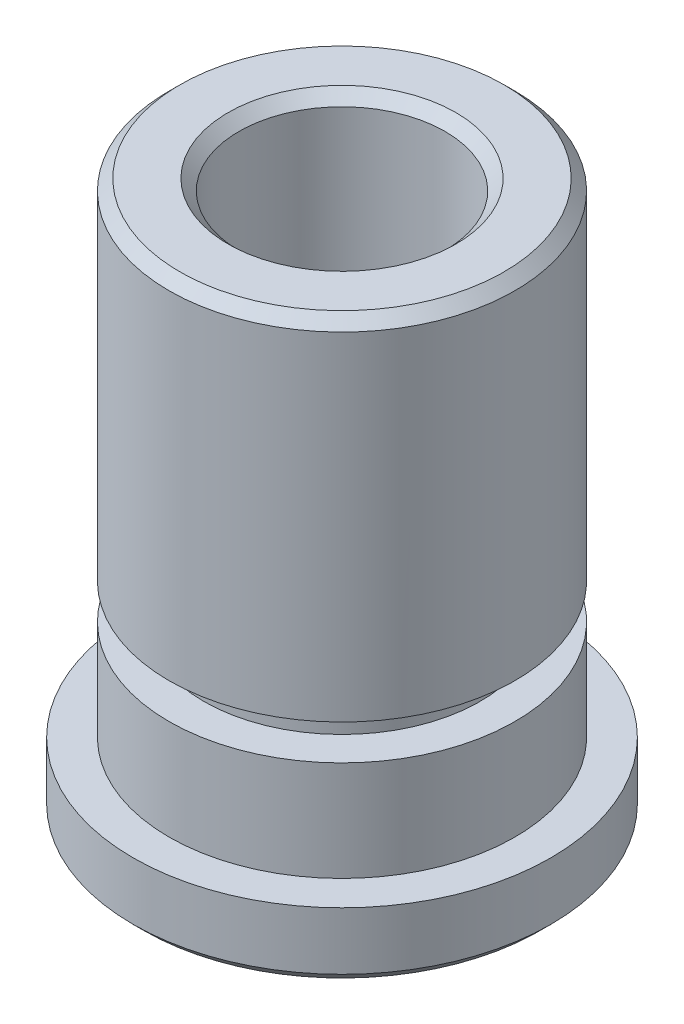
ISO-10303-21;
HEADER;
FILE_DESCRIPTION(('STEP AP214'),'2;1');
FILE_NAME('part.step','',(''),(''),'','','');
FILE_SCHEMA(('AUTOMOTIVE_DESIGN { 1 0 10303 214 1 1 1 1 }'));
ENDSEC;
DATA;
#1=APPLICATION_CONTEXT('core data for automotive mechanical design processes');
#2=APPLICATION_PROTOCOL_DEFINITION('international standard','automotive_design',2000,#1);
#3=PRODUCT_CONTEXT('',#1,'mechanical');
#4=PRODUCT('Part','Part','',(#3));
#5=PRODUCT_RELATED_PRODUCT_CATEGORY('part','',(#4));
#6=PRODUCT_DEFINITION_FORMATION('','',#4);
#7=PRODUCT_DEFINITION_CONTEXT('part definition',#1,'design');
#8=PRODUCT_DEFINITION('design','',#6,#7);
#9=PRODUCT_DEFINITION_SHAPE('','',#8);
#10=(LENGTH_UNIT() NAMED_UNIT(*) SI_UNIT(.MILLI.,.METRE.));
#11=(NAMED_UNIT(*) PLANE_ANGLE_UNIT() SI_UNIT($,.RADIAN.));
#12=(NAMED_UNIT(*) SI_UNIT($,.STERADIAN.) SOLID_ANGLE_UNIT());
#13=UNCERTAINTY_MEASURE_WITH_UNIT(LENGTH_MEASURE(1.E-05),#10,'distance_accuracy_value','');
#14=(GEOMETRIC_REPRESENTATION_CONTEXT(3) GLOBAL_UNCERTAINTY_ASSIGNED_CONTEXT((#13)) GLOBAL_UNIT_ASSIGNED_CONTEXT((#10,
#11,#12)) REPRESENTATION_CONTEXT('',''));
#15=CARTESIAN_POINT('',(0.,0.,0.));
#16=DIRECTION('',(0.,0.,1.));
#17=DIRECTION('',(1.,0.,0.));
#18=AXIS2_PLACEMENT_3D('',#15,#16,#17);
#19=CARTESIAN_POINT('',(0.,-1.35992436178104,0.));
#20=DIRECTION('',(0.,1.,0.));
#21=DIRECTION('',(0.,0.,1.));
#22=AXIS2_PLACEMENT_3D('',#19,#20,#21);
#23=CYLINDRICAL_SURFACE('',#22,2.36855);
#24=CARTESIAN_POINT('',(0.,12.45,0.));
#25=DIRECTION('',(0.,-1.,0.));
#26=DIRECTION('',(0.,0.,-1.));
#27=AXIS2_PLACEMENT_3D('',#24,#25,#26);
#28=CIRCLE('',#27,2.36855);
#29=CARTESIAN_POINT('',(0.,12.45,-2.36855));
#30=VERTEX_POINT('',#29);
#31=EDGE_CURVE('E58',#30,#30,#28,.F.);
#32=ORIENTED_EDGE('',*,*,#31,.T.);
#33=EDGE_LOOP('',(#32));
#34=FACE_BOUND('',#33,.T.);
#35=CARTESIAN_POINT('',(0.,0.249999999999997,0.));
#36=DIRECTION('',(0.,1.,0.));
#37=DIRECTION('',(0.,0.,1.));
#38=AXIS2_PLACEMENT_3D('',#35,#36,#37);
#39=CIRCLE('',#38,2.36855);
#40=CARTESIAN_POINT('',(0.,0.249999999999997,2.36855));
#41=VERTEX_POINT('',#40);
#42=EDGE_CURVE('E61',#41,#41,#39,.F.);
#43=ORIENTED_EDGE('',*,*,#42,.T.);
#44=EDGE_LOOP('',(#43));
#45=FACE_BOUND('',#44,.T.);
#46=ADVANCED_FACE('F32',(#34,#45),#23,.F.);
#47=CARTESIAN_POINT('',(0.,0.,-2.36855));
#48=DIRECTION('',(0.,1.,0.));
#49=DIRECTION('',(0.,0.,1.));
#50=AXIS2_PLACEMENT_3D('',#47,#48,#49);
#51=PLANE('',#50);
#52=CARTESIAN_POINT('',(0.,0.,0.));
#53=DIRECTION('',(0.,1.,0.));
#54=DIRECTION('',(0.,0.,1.));
#55=AXIS2_PLACEMENT_3D('',#52,#53,#54);
#56=CIRCLE('',#55,4.5506);
#57=CARTESIAN_POINT('',(0.,0.,4.5506));
#58=VERTEX_POINT('',#57);
#59=EDGE_CURVE('E39',#58,#58,#56,.F.);
#60=ORIENTED_EDGE('',*,*,#59,.T.);
#61=EDGE_LOOP('',(#60));
#62=FACE_BOUND('',#61,.T.);
#63=CARTESIAN_POINT('',(0.,0.,0.));
#64=DIRECTION('',(0.,1.,0.));
#65=DIRECTION('',(0.,0.,1.));
#66=AXIS2_PLACEMENT_3D('',#63,#64,#65);
#67=CIRCLE('',#66,2.61855);
#68=CARTESIAN_POINT('',(0.,0.,2.61855));
#69=VERTEX_POINT('',#68);
#70=EDGE_CURVE('E43',#69,#69,#67,.T.);
#71=ORIENTED_EDGE('',*,*,#70,.T.);
#72=EDGE_LOOP('',(#71));
#73=FACE_BOUND('',#72,.T.);
#74=ADVANCED_FACE('F117',(#62,#73),#51,.F.);
#75=CARTESIAN_POINT('',(0.,-1.35992436178104,0.));
#76=DIRECTION('',(0.,1.,0.));
#77=DIRECTION('',(0.,0.,1.));
#78=AXIS2_PLACEMENT_3D('',#75,#76,#77);
#79=CYLINDRICAL_SURFACE('',#78,4.8006);
#80=CARTESIAN_POINT('',(0.,0.25,0.));
#81=DIRECTION('',(0.,1.,0.));
#82=DIRECTION('',(0.,0.,1.));
#83=AXIS2_PLACEMENT_3D('',#80,#81,#82);
#84=CIRCLE('',#83,4.8006);
#85=CARTESIAN_POINT('',(0.,0.25,4.8006));
#86=VERTEX_POINT('',#85);
#87=EDGE_CURVE('E47',#86,#86,#84,.T.);
#88=ORIENTED_EDGE('',*,*,#87,.T.);
#89=EDGE_LOOP('',(#88));
#90=FACE_BOUND('',#89,.T.);
#91=CARTESIAN_POINT('',(0.,1.5748,0.));
#92=DIRECTION('',(0.,1.,0.));
#93=DIRECTION('',(0.,0.,1.));
#94=AXIS2_PLACEMENT_3D('',#91,#92,#93);
#95=CIRCLE('',#94,4.8006);
#96=CARTESIAN_POINT('',(0.,1.5748,4.8006));
#97=VERTEX_POINT('',#96);
#98=EDGE_CURVE('E64',#97,#97,#95,.T.);
#99=ORIENTED_EDGE('',*,*,#98,.F.);
#100=EDGE_LOOP('',(#99));
#101=FACE_BOUND('',#100,.T.);
#102=ADVANCED_FACE('F112',(#90,#101),#79,.T.);
#103=CARTESIAN_POINT('',(0.,1.5748,-4.8006));
#104=DIRECTION('',(0.,-1.,0.));
#105=DIRECTION('',(0.,0.,-1.));
#106=AXIS2_PLACEMENT_3D('',#103,#104,#105);
#107=PLANE('',#106);
#108=CARTESIAN_POINT('',(0.,1.5748,0.));
#109=DIRECTION('',(0.,1.,0.));
#110=DIRECTION('',(0.,0.,1.));
#111=AXIS2_PLACEMENT_3D('',#108,#109,#110);
#112=CIRCLE('',#111,3.9751);
#113=CARTESIAN_POINT('',(0.,1.5748,3.9751));
#114=VERTEX_POINT('',#113);
#115=EDGE_CURVE('E67',#114,#114,#112,.T.);
#116=ORIENTED_EDGE('',*,*,#115,.F.);
#117=EDGE_LOOP('',(#116));
#118=FACE_BOUND('',#117,.T.);
#119=ORIENTED_EDGE('',*,*,#98,.T.);
#120=EDGE_LOOP('',(#119));
#121=FACE_BOUND('',#120,.T.);
#122=ADVANCED_FACE('F106',(#118,#121),#107,.F.);
#123=CARTESIAN_POINT('',(0.,-1.35992436178104,0.));
#124=DIRECTION('',(0.,1.,0.));
#125=DIRECTION('',(0.,0.,1.));
#126=AXIS2_PLACEMENT_3D('',#123,#124,#125);
#127=CYLINDRICAL_SURFACE('',#126,3.9751);
#128=CARTESIAN_POINT('',(0.,3.8748,0.));
#129=DIRECTION('',(0.,1.,0.));
#130=DIRECTION('',(0.,0.,1.));
#131=AXIS2_PLACEMENT_3D('',#128,#129,#130);
#132=CIRCLE('',#131,3.9751);
#133=CARTESIAN_POINT('',(0.,3.8748,3.9751));
#134=VERTEX_POINT('',#133);
#135=EDGE_CURVE('E70',#134,#134,#132,.T.);
#136=ORIENTED_EDGE('',*,*,#135,.F.);
#137=EDGE_LOOP('',(#136));
#138=FACE_BOUND('',#137,.T.);
#139=ORIENTED_EDGE('',*,*,#115,.T.);
#140=EDGE_LOOP('',(#139));
#141=FACE_BOUND('',#140,.T.);
#142=ADVANCED_FACE('F100',(#138,#141),#127,.T.);
#143=CARTESIAN_POINT('',(0.,3.8748,-3.9751));
#144=DIRECTION('',(0.,-1.,0.));
#145=DIRECTION('',(0.,0.,-1.));
#146=AXIS2_PLACEMENT_3D('',#143,#144,#145);
#147=PLANE('',#146);
#148=CARTESIAN_POINT('',(0.,3.8748,0.));
#149=DIRECTION('',(0.,1.,0.));
#150=DIRECTION('',(0.,0.,1.));
#151=AXIS2_PLACEMENT_3D('',#148,#149,#150);
#152=CIRCLE('',#151,3.175);
#153=CARTESIAN_POINT('',(0.,3.8748,3.175));
#154=VERTEX_POINT('',#153);
#155=EDGE_CURVE('E73',#154,#154,#152,.T.);
#156=ORIENTED_EDGE('',*,*,#155,.F.);
#157=EDGE_LOOP('',(#156));
#158=FACE_BOUND('',#157,.T.);
#159=ORIENTED_EDGE('',*,*,#135,.T.);
#160=EDGE_LOOP('',(#159));
#161=FACE_BOUND('',#160,.T.);
#162=ADVANCED_FACE('F94',(#158,#161),#147,.F.);
#163=CARTESIAN_POINT('',(0.,-1.35992436178104,0.));
#164=DIRECTION('',(0.,1.,0.));
#165=DIRECTION('',(0.,0.,1.));
#166=AXIS2_PLACEMENT_3D('',#163,#164,#165);
#167=CYLINDRICAL_SURFACE('',#166,3.175);
#168=CARTESIAN_POINT('',(0.,4.6876,0.));
#169=DIRECTION('',(0.,1.,0.));
#170=DIRECTION('',(0.,0.,1.));
#171=AXIS2_PLACEMENT_3D('',#168,#169,#170);
#172=CIRCLE('',#171,3.175);
#173=CARTESIAN_POINT('',(0.,4.6876,3.175));
#174=VERTEX_POINT('',#173);
#175=EDGE_CURVE('E76',#174,#174,#172,.T.);
#176=ORIENTED_EDGE('',*,*,#175,.F.);
#177=EDGE_LOOP('',(#176));
#178=FACE_BOUND('',#177,.T.);
#179=ORIENTED_EDGE('',*,*,#155,.T.);
#180=EDGE_LOOP('',(#179));
#181=FACE_BOUND('',#180,.T.);
#182=ADVANCED_FACE('F88',(#178,#181),#167,.T.);
#183=CARTESIAN_POINT('',(0.,4.6876,-3.9751));
#184=DIRECTION('',(0.,1.,0.));
#185=DIRECTION('',(0.,0.,1.));
#186=AXIS2_PLACEMENT_3D('',#183,#184,#185);
#187=PLANE('',#186);
#188=CARTESIAN_POINT('',(0.,4.6876,0.));
#189=DIRECTION('',(0.,1.,0.));
#190=DIRECTION('',(0.,0.,1.));
#191=AXIS2_PLACEMENT_3D('',#188,#189,#190);
#192=CIRCLE('',#191,3.9751);
#193=CARTESIAN_POINT('',(0.,4.6876,3.9751));
#194=VERTEX_POINT('',#193);
#195=EDGE_CURVE('E79',#194,#194,#192,.T.);
#196=ORIENTED_EDGE('',*,*,#195,.F.);
#197=EDGE_LOOP('',(#196));
#198=FACE_BOUND('',#197,.T.);
#199=ORIENTED_EDGE('',*,*,#175,.T.);
#200=EDGE_LOOP('',(#199));
#201=FACE_BOUND('',#200,.T.);
#202=ADVANCED_FACE('F85',(#198,#201),#187,.F.);
#203=CARTESIAN_POINT('',(0.,-1.35992436178104,0.));
#204=DIRECTION('',(0.,1.,0.));
#205=DIRECTION('',(0.,0.,1.));
#206=AXIS2_PLACEMENT_3D('',#203,#204,#205);
#207=CYLINDRICAL_SURFACE('',#206,3.9751);
#208=CARTESIAN_POINT('',(0.,12.45,0.));
#209=DIRECTION('',(0.,-1.,0.));
#210=DIRECTION('',(0.,0.,-1.));
#211=AXIS2_PLACEMENT_3D('',#208,#209,#210);
#212=CIRCLE('',#211,3.9751);
#213=CARTESIAN_POINT('',(0.,12.45,-3.9751));
#214=VERTEX_POINT('',#213);
#215=EDGE_CURVE('E10',#214,#214,#212,.T.);
#216=ORIENTED_EDGE('',*,*,#215,.T.);
#217=EDGE_LOOP('',(#216));
#218=FACE_BOUND('',#217,.T.);
#219=ORIENTED_EDGE('',*,*,#195,.T.);
#220=EDGE_LOOP('',(#219));
#221=FACE_BOUND('',#220,.T.);
#222=ADVANCED_FACE('F83',(#218,#221),#207,.T.);
#223=CARTESIAN_POINT('',(0.,12.7,-2.36855));
#224=DIRECTION('',(0.,-1.,0.));
#225=DIRECTION('',(0.,0.,-1.));
#226=AXIS2_PLACEMENT_3D('',#223,#224,#225);
#227=PLANE('',#226);
#228=CARTESIAN_POINT('',(0.,12.7,0.));
#229=DIRECTION('',(0.,-1.,0.));
#230=DIRECTION('',(0.,0.,-1.));
#231=AXIS2_PLACEMENT_3D('',#228,#229,#230);
#232=CIRCLE('',#231,2.61855);
#233=CARTESIAN_POINT('',(0.,12.7,-2.61855));
#234=VERTEX_POINT('',#233);
#235=EDGE_CURVE('E52',#234,#234,#232,.T.);
#236=ORIENTED_EDGE('',*,*,#235,.T.);
#237=EDGE_LOOP('',(#236));
#238=FACE_BOUND('',#237,.T.);
#239=CARTESIAN_POINT('',(0.,12.7,0.));
#240=DIRECTION('',(0.,-1.,0.));
#241=DIRECTION('',(0.,0.,-1.));
#242=AXIS2_PLACEMENT_3D('',#239,#240,#241);
#243=CIRCLE('',#242,3.7251);
#244=CARTESIAN_POINT('',(0.,12.7,-3.7251));
#245=VERTEX_POINT('',#244);
#246=EDGE_CURVE('E55',#245,#245,#243,.F.);
#247=ORIENTED_EDGE('',*,*,#246,.T.);
#248=EDGE_LOOP('',(#247));
#249=FACE_BOUND('',#248,.T.);
#250=ADVANCED_FACE('F135',(#238,#249),#227,.F.);
#251=CARTESIAN_POINT('',(0.,12.45,0.));
#252=DIRECTION('',(0.,1.,0.));
#253=DIRECTION('',(0.,0.,1.));
#254=AXIS2_PLACEMENT_3D('',#251,#252,#253);
#255=CONICAL_SURFACE('',#254,2.36855,0.785398163397454);
#256=ORIENTED_EDGE('',*,*,#235,.F.);
#257=EDGE_LOOP('',(#256));
#258=FACE_BOUND('',#257,.T.);
#259=ORIENTED_EDGE('',*,*,#31,.F.);
#260=EDGE_LOOP('',(#259));
#261=FACE_BOUND('',#260,.T.);
#262=ADVANCED_FACE('F131',(#258,#261),#255,.F.);
#263=CARTESIAN_POINT('',(0.,0.25,0.));
#264=DIRECTION('',(0.,1.,0.));
#265=DIRECTION('',(0.,0.,1.));
#266=AXIS2_PLACEMENT_3D('',#263,#264,#265);
#267=CONICAL_SURFACE('',#266,4.8006,0.78539816339745);
#268=ORIENTED_EDGE('',*,*,#59,.F.);
#269=EDGE_LOOP('',(#268));
#270=FACE_BOUND('',#269,.T.);
#271=ORIENTED_EDGE('',*,*,#87,.F.);
#272=EDGE_LOOP('',(#271));
#273=FACE_BOUND('',#272,.T.);
#274=ADVANCED_FACE('F134',(#270,#273),#267,.T.);
#275=CARTESIAN_POINT('',(0.,12.7,0.));
#276=DIRECTION('',(0.,-1.,0.));
#277=DIRECTION('',(0.,0.,-1.));
#278=AXIS2_PLACEMENT_3D('',#275,#276,#277);
#279=CONICAL_SURFACE('',#278,3.7251,0.785398163397448);
#280=ORIENTED_EDGE('',*,*,#215,.F.);
#281=EDGE_LOOP('',(#280));
#282=FACE_BOUND('',#281,.T.);
#283=ORIENTED_EDGE('',*,*,#246,.F.);
#284=EDGE_LOOP('',(#283));
#285=FACE_BOUND('',#284,.T.);
#286=ADVANCED_FACE('F138',(#282,#285),#279,.T.);
#287=CARTESIAN_POINT('',(0.,0.,0.));
#288=DIRECTION('',(0.,-1.,0.));
#289=DIRECTION('',(0.,0.,-1.));
#290=AXIS2_PLACEMENT_3D('',#287,#288,#289);
#291=CONICAL_SURFACE('',#290,2.61855,0.785398163397451);
#292=ORIENTED_EDGE('',*,*,#42,.F.);
#293=EDGE_LOOP('',(#292));
#294=FACE_BOUND('',#293,.T.);
#295=ORIENTED_EDGE('',*,*,#70,.F.);
#296=EDGE_LOOP('',(#295));
#297=FACE_BOUND('',#296,.T.);
#298=ADVANCED_FACE('F34',(#294,#297),#291,.F.);
#299=CLOSED_SHELL('',(#46,#74,#102,#122,#142,#162,#182,#202,#222,#250,#262,#274,#286,#298));
#300=MANIFOLD_SOLID_BREP('B2',#299);
#301=ADVANCED_BREP_SHAPE_REPRESENTATION('',(#18,#300),#14);
#302=SHAPE_DEFINITION_REPRESENTATION(#9,#301);
ENDSEC;
END-ISO-10303-21;
